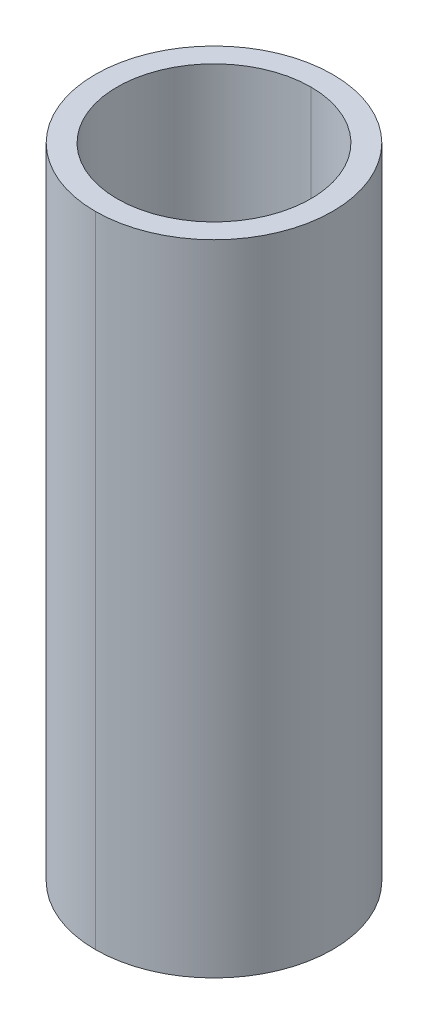
ISO-10303-21;
HEADER;
FILE_DESCRIPTION(('STEP AP214'),'2;1');
FILE_NAME('part.step','',(''),(''),'','','');
FILE_SCHEMA(('AUTOMOTIVE_DESIGN { 1 0 10303 214 1 1 1 1 }'));
ENDSEC;
DATA;
#1=APPLICATION_CONTEXT('core data for automotive mechanical design processes');
#2=APPLICATION_PROTOCOL_DEFINITION('international standard','automotive_design',2000,#1);
#3=PRODUCT_CONTEXT('',#1,'mechanical');
#4=PRODUCT('Part','Part','',(#3));
#5=PRODUCT_RELATED_PRODUCT_CATEGORY('part','',(#4));
#6=PRODUCT_DEFINITION_FORMATION('','',#4);
#7=PRODUCT_DEFINITION_CONTEXT('part definition',#1,'design');
#8=PRODUCT_DEFINITION('design','',#6,#7);
#9=PRODUCT_DEFINITION_SHAPE('','',#8);
#10=(LENGTH_UNIT() NAMED_UNIT(*) SI_UNIT(.MILLI.,.METRE.));
#11=(NAMED_UNIT(*) PLANE_ANGLE_UNIT() SI_UNIT($,.RADIAN.));
#12=(NAMED_UNIT(*) SI_UNIT($,.STERADIAN.) SOLID_ANGLE_UNIT());
#13=UNCERTAINTY_MEASURE_WITH_UNIT(LENGTH_MEASURE(1.E-05),#10,'distance_accuracy_value','');
#14=(GEOMETRIC_REPRESENTATION_CONTEXT(3) GLOBAL_UNCERTAINTY_ASSIGNED_CONTEXT((#13)) GLOBAL_UNIT_ASSIGNED_CONTEXT((#10,
#11,#12)) REPRESENTATION_CONTEXT('',''));
#15=CARTESIAN_POINT('',(0.,0.,0.));
#16=DIRECTION('',(0.,0.,1.));
#17=DIRECTION('',(1.,0.,0.));
#18=AXIS2_PLACEMENT_3D('',#15,#16,#17);
#19=CARTESIAN_POINT('',(0.,162.5,0.));
#20=DIRECTION('',(0.,-1.,0.));
#21=DIRECTION('',(0.,0.,-1.));
#22=AXIS2_PLACEMENT_3D('',#19,#20,#21);
#23=CYLINDRICAL_SURFACE('',#22,24.62);
#24=DIRECTION('',(0.,-1.,0.));
#25=VECTOR('',#24,1.);
#26=CARTESIAN_POINT('',(0.,162.5,24.62));
#27=LINE('',#26,#25);
#28=CARTESIAN_POINT('',(0.,162.5,24.62));
#29=VERTEX_POINT('',#28);
#30=CARTESIAN_POINT('',(0.,0.,24.62));
#31=VERTEX_POINT('',#30);
#32=EDGE_CURVE('E66',#29,#31,#27,.T.);
#33=ORIENTED_EDGE('',*,*,#32,.F.);
#34=CARTESIAN_POINT('',(0.,162.5,0.));
#35=DIRECTION('',(0.,1.,0.));
#36=DIRECTION('',(0.,0.,1.));
#37=AXIS2_PLACEMENT_3D('',#34,#35,#36);
#38=CIRCLE('',#37,24.62);
#39=CARTESIAN_POINT('',(0.,162.5,-24.62));
#40=VERTEX_POINT('',#39);
#41=EDGE_CURVE('E92',#29,#40,#38,.T.);
#42=ORIENTED_EDGE('',*,*,#41,.T.);
#43=DIRECTION('',(0.,-1.,0.));
#44=VECTOR('',#43,1.);
#45=CARTESIAN_POINT('',(0.,162.5,-24.62));
#46=LINE('',#45,#44);
#47=CARTESIAN_POINT('',(0.,0.,-24.62));
#48=VERTEX_POINT('',#47);
#49=EDGE_CURVE('E69',#40,#48,#46,.T.);
#50=ORIENTED_EDGE('',*,*,#49,.T.);
#51=CARTESIAN_POINT('',(0.,0.,0.));
#52=DIRECTION('',(0.,1.,0.));
#53=DIRECTION('',(0.,0.,1.));
#54=AXIS2_PLACEMENT_3D('',#51,#52,#53);
#55=CIRCLE('',#54,24.62);
#56=EDGE_CURVE('E11',#31,#48,#55,.T.);
#57=ORIENTED_EDGE('',*,*,#56,.F.);
#58=EDGE_LOOP('',(#33,#42,#50,#57));
#59=FACE_BOUND('',#58,.T.);
#60=ADVANCED_FACE('F17',(#59),#23,.F.);
#61=CARTESIAN_POINT('',(0.,162.5,0.));
#62=DIRECTION('',(0.,-1.,0.));
#63=DIRECTION('',(0.,0.,-1.));
#64=AXIS2_PLACEMENT_3D('',#61,#62,#63);
#65=CYLINDRICAL_SURFACE('',#64,30.16);
#66=DIRECTION('',(0.,-1.,0.));
#67=VECTOR('',#66,1.);
#68=CARTESIAN_POINT('',(0.,162.5,30.16));
#69=LINE('',#68,#67);
#70=CARTESIAN_POINT('',(0.,162.5,30.16));
#71=VERTEX_POINT('',#70);
#72=CARTESIAN_POINT('',(0.,0.,30.16));
#73=VERTEX_POINT('',#72);
#74=EDGE_CURVE('E98',#71,#73,#69,.T.);
#75=ORIENTED_EDGE('',*,*,#74,.F.);
#76=CARTESIAN_POINT('',(0.,162.5,0.));
#77=DIRECTION('',(0.,1.,0.));
#78=DIRECTION('',(0.,0.,1.));
#79=AXIS2_PLACEMENT_3D('',#76,#77,#78);
#80=CIRCLE('',#79,30.16);
#81=CARTESIAN_POINT('',(0.,162.5,-30.16));
#82=VERTEX_POINT('',#81);
#83=EDGE_CURVE('E117',#82,#71,#80,.T.);
#84=ORIENTED_EDGE('',*,*,#83,.F.);
#85=DIRECTION('',(0.,-1.,0.));
#86=VECTOR('',#85,1.);
#87=CARTESIAN_POINT('',(0.,162.5,-30.16));
#88=LINE('',#87,#86);
#89=CARTESIAN_POINT('',(0.,0.,-30.16));
#90=VERTEX_POINT('',#89);
#91=EDGE_CURVE('E88',#82,#90,#88,.T.);
#92=ORIENTED_EDGE('',*,*,#91,.T.);
#93=CARTESIAN_POINT('',(0.,0.,0.));
#94=DIRECTION('',(0.,1.,0.));
#95=DIRECTION('',(0.,0.,1.));
#96=AXIS2_PLACEMENT_3D('',#93,#94,#95);
#97=CIRCLE('',#96,30.16);
#98=EDGE_CURVE('E27',#90,#73,#97,.T.);
#99=ORIENTED_EDGE('',*,*,#98,.T.);
#100=EDGE_LOOP('',(#75,#84,#92,#99));
#101=FACE_BOUND('',#100,.T.);
#102=ADVANCED_FACE('F131',(#101),#65,.T.);
#103=CARTESIAN_POINT('',(0.,0.,0.));
#104=DIRECTION('',(0.,1.,0.));
#105=DIRECTION('',(1.,0.,0.));
#106=AXIS2_PLACEMENT_3D('',#103,#104,#105);
#107=PLANE('',#106);
#108=CARTESIAN_POINT('',(0.,0.,0.));
#109=DIRECTION('',(0.,1.,0.));
#110=DIRECTION('',(0.,0.,1.));
#111=AXIS2_PLACEMENT_3D('',#108,#109,#110);
#112=CIRCLE('',#111,24.62);
#113=EDGE_CURVE('E72',#48,#31,#112,.T.);
#114=ORIENTED_EDGE('',*,*,#113,.T.);
#115=ORIENTED_EDGE('',*,*,#56,.T.);
#116=EDGE_LOOP('',(#114,#115));
#117=FACE_BOUND('',#116,.T.);
#118=ORIENTED_EDGE('',*,*,#98,.F.);
#119=CARTESIAN_POINT('',(0.,0.,0.));
#120=DIRECTION('',(0.,1.,0.));
#121=DIRECTION('',(0.,0.,1.));
#122=AXIS2_PLACEMENT_3D('',#119,#120,#121);
#123=CIRCLE('',#122,30.16);
#124=EDGE_CURVE('E107',#73,#90,#123,.T.);
#125=ORIENTED_EDGE('',*,*,#124,.F.);
#126=EDGE_LOOP('',(#118,#125));
#127=FACE_BOUND('',#126,.T.);
#128=ADVANCED_FACE('F73',(#117,#127),#107,.F.);
#129=CARTESIAN_POINT('',(0.,162.5,0.));
#130=DIRECTION('',(0.,1.,0.));
#131=DIRECTION('',(1.,0.,0.));
#132=AXIS2_PLACEMENT_3D('',#129,#130,#131);
#133=PLANE('',#132);
#134=CARTESIAN_POINT('',(0.,162.5,0.));
#135=DIRECTION('',(0.,1.,0.));
#136=DIRECTION('',(0.,0.,1.));
#137=AXIS2_PLACEMENT_3D('',#134,#135,#136);
#138=CIRCLE('',#137,24.62);
#139=EDGE_CURVE('E79',#40,#29,#138,.T.);
#140=ORIENTED_EDGE('',*,*,#139,.F.);
#141=ORIENTED_EDGE('',*,*,#41,.F.);
#142=EDGE_LOOP('',(#140,#141));
#143=FACE_BOUND('',#142,.T.);
#144=ORIENTED_EDGE('',*,*,#83,.T.);
#145=CARTESIAN_POINT('',(0.,162.5,0.));
#146=DIRECTION('',(0.,1.,0.));
#147=DIRECTION('',(0.,0.,1.));
#148=AXIS2_PLACEMENT_3D('',#145,#146,#147);
#149=CIRCLE('',#148,30.16);
#150=EDGE_CURVE('E20',#71,#82,#149,.T.);
#151=ORIENTED_EDGE('',*,*,#150,.T.);
#152=EDGE_LOOP('',(#144,#151));
#153=FACE_BOUND('',#152,.T.);
#154=ADVANCED_FACE('F123',(#143,#153),#133,.T.);
#155=CARTESIAN_POINT('',(0.,162.5,0.));
#156=DIRECTION('',(0.,-1.,0.));
#157=DIRECTION('',(0.,0.,-1.));
#158=AXIS2_PLACEMENT_3D('',#155,#156,#157);
#159=CYLINDRICAL_SURFACE('',#158,30.16);
#160=ORIENTED_EDGE('',*,*,#150,.F.);
#161=ORIENTED_EDGE('',*,*,#74,.T.);
#162=ORIENTED_EDGE('',*,*,#124,.T.);
#163=ORIENTED_EDGE('',*,*,#91,.F.);
#164=EDGE_LOOP('',(#160,#161,#162,#163));
#165=FACE_BOUND('',#164,.T.);
#166=ADVANCED_FACE('F125',(#165),#159,.T.);
#167=CARTESIAN_POINT('',(0.,162.5,0.));
#168=DIRECTION('',(0.,-1.,0.));
#169=DIRECTION('',(0.,0.,-1.));
#170=AXIS2_PLACEMENT_3D('',#167,#168,#169);
#171=CYLINDRICAL_SURFACE('',#170,24.62);
#172=ORIENTED_EDGE('',*,*,#139,.T.);
#173=ORIENTED_EDGE('',*,*,#32,.T.);
#174=ORIENTED_EDGE('',*,*,#113,.F.);
#175=ORIENTED_EDGE('',*,*,#49,.F.);
#176=EDGE_LOOP('',(#172,#173,#174,#175));
#177=FACE_BOUND('',#176,.T.);
#178=ADVANCED_FACE('F77',(#177),#171,.F.);
#179=CLOSED_SHELL('',(#60,#102,#128,#154,#166,#178));
#180=MANIFOLD_SOLID_BREP('B1',#179);
#181=ADVANCED_BREP_SHAPE_REPRESENTATION('',(#18,#180),#14);
#182=SHAPE_DEFINITION_REPRESENTATION(#9,#181);
ENDSEC;
END-ISO-10303-21;
